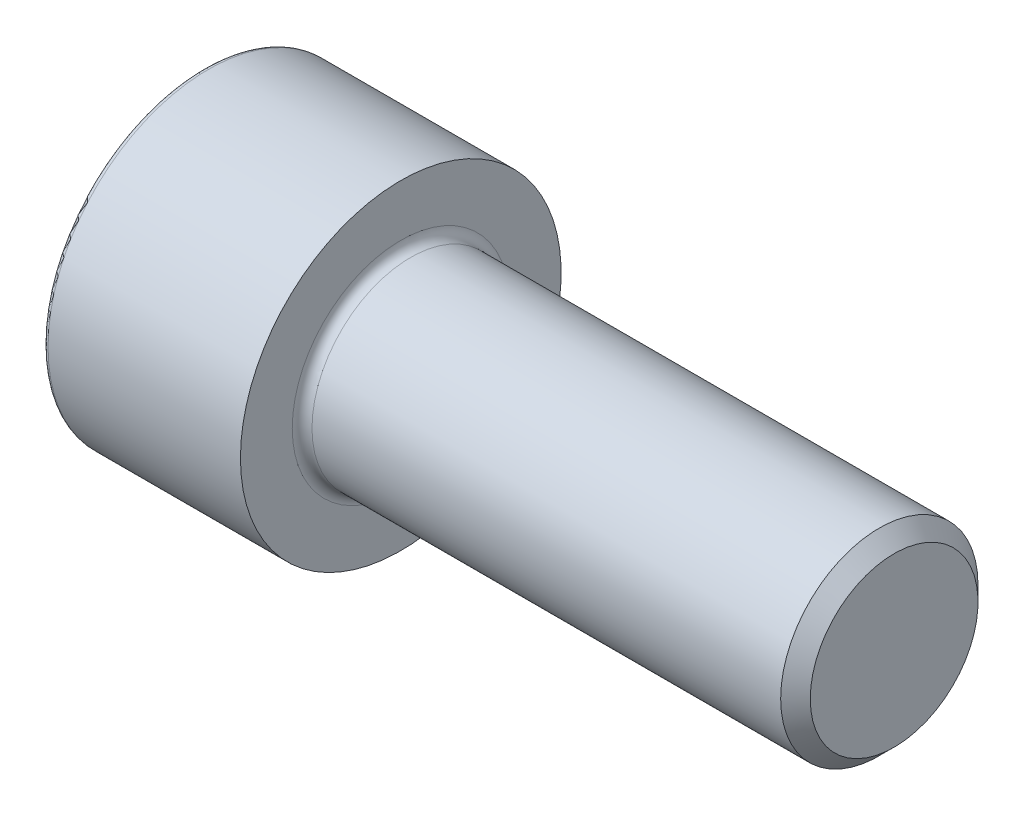
ISO-10303-21;
HEADER;
FILE_DESCRIPTION(('STEP AP214'),'2;1');
FILE_NAME('part.step','',(''),(''),'','','');
FILE_SCHEMA(('AUTOMOTIVE_DESIGN { 1 0 10303 214 1 1 1 1 }'));
ENDSEC;
DATA;
#1=APPLICATION_CONTEXT('core data for automotive mechanical design processes');
#2=APPLICATION_PROTOCOL_DEFINITION('international standard','automotive_design',2000,#1);
#3=PRODUCT_CONTEXT('',#1,'mechanical');
#4=PRODUCT('Part','Part','',(#3));
#5=PRODUCT_RELATED_PRODUCT_CATEGORY('part','',(#4));
#6=PRODUCT_DEFINITION_FORMATION('','',#4);
#7=PRODUCT_DEFINITION_CONTEXT('part definition',#1,'design');
#8=PRODUCT_DEFINITION('design','',#6,#7);
#9=PRODUCT_DEFINITION_SHAPE('','',#8);
#10=(LENGTH_UNIT() NAMED_UNIT(*) SI_UNIT(.MILLI.,.METRE.));
#11=(NAMED_UNIT(*) PLANE_ANGLE_UNIT() SI_UNIT($,.RADIAN.));
#12=(NAMED_UNIT(*) SI_UNIT($,.STERADIAN.) SOLID_ANGLE_UNIT());
#13=UNCERTAINTY_MEASURE_WITH_UNIT(LENGTH_MEASURE(1.E-05),#10,'distance_accuracy_value','');
#14=(GEOMETRIC_REPRESENTATION_CONTEXT(3) GLOBAL_UNCERTAINTY_ASSIGNED_CONTEXT((#13)) GLOBAL_UNIT_ASSIGNED_CONTEXT((#10,
#11,#12)) REPRESENTATION_CONTEXT('',''));
#15=CARTESIAN_POINT('',(0.,0.,0.));
#16=DIRECTION('',(0.,0.,1.));
#17=DIRECTION('',(1.,0.,0.));
#18=AXIS2_PLACEMENT_3D('',#15,#16,#17);
#19=CARTESIAN_POINT('',(0.,0.,0.));
#20=DIRECTION('',(1.,0.,0.));
#21=DIRECTION('',(0.,0.,-1.));
#22=AXIS2_PLACEMENT_3D('',#19,#20,#21);
#23=PLANE('',#22);
#24=CARTESIAN_POINT('',(0.,0.,0.));
#25=DIRECTION('',(1.,0.,0.));
#26=DIRECTION('',(0.,0.,-1.));
#27=AXIS2_PLACEMENT_3D('',#24,#25,#26);
#28=CIRCLE('',#27,6.3);
#29=CARTESIAN_POINT('',(0.,0.,-6.3));
#30=VERTEX_POINT('',#29);
#31=EDGE_CURVE('E180',#30,#30,#28,.F.);
#32=ORIENTED_EDGE('',*,*,#31,.T.);
#33=EDGE_LOOP('',(#32));
#34=FACE_BOUND('',#33,.T.);
#35=DIRECTION('',(0.,0.5,-0.866025403784439));
#36=VECTOR('',#35,1.);
#37=CARTESIAN_POINT('',(0.,1.73205080756889,3.));
#38=LINE('',#37,#36);
#39=CARTESIAN_POINT('',(0.,1.73205080756889,3.));
#40=VERTEX_POINT('',#39);
#41=CARTESIAN_POINT('',(0.,3.46410161513777,2.22044604925031E-13));
#42=VERTEX_POINT('',#41);
#43=EDGE_CURVE('E149',#40,#42,#38,.T.);
#44=ORIENTED_EDGE('',*,*,#43,.F.);
#45=DIRECTION('',(0.,1.,0.));
#46=VECTOR('',#45,1.);
#47=CARTESIAN_POINT('',(0.,-1.73205080756905,2.99999999999989));
#48=LINE('',#47,#46);
#49=CARTESIAN_POINT('',(0.,-1.73205080756905,2.99999999999989));
#50=VERTEX_POINT('',#49);
#51=EDGE_CURVE('E51',#50,#40,#48,.T.);
#52=ORIENTED_EDGE('',*,*,#51,.F.);
#53=DIRECTION('',(0.,0.5,0.866025403784439));
#54=VECTOR('',#53,1.);
#55=CARTESIAN_POINT('',(0.,-3.46410161513772,1.11022302462516E-13));
#56=LINE('',#55,#54);
#57=CARTESIAN_POINT('',(0.,-3.46410161513772,1.11022302462516E-13));
#58=VERTEX_POINT('',#57);
#59=EDGE_CURVE('E117',#58,#50,#56,.T.);
#60=ORIENTED_EDGE('',*,*,#59,.F.);
#61=DIRECTION('',(0.,-0.5,0.866025403784439));
#62=VECTOR('',#61,1.);
#63=CARTESIAN_POINT('',(0.,-1.73205080756883,-3.00000000000011));
#64=LINE('',#63,#62);
#65=CARTESIAN_POINT('',(0.,-1.73205080756883,-3.00000000000011));
#66=VERTEX_POINT('',#65);
#67=EDGE_CURVE('E157',#66,#58,#64,.T.);
#68=ORIENTED_EDGE('',*,*,#67,.F.);
#69=DIRECTION('',(0.,-1.,0.));
#70=VECTOR('',#69,1.);
#71=CARTESIAN_POINT('',(0.,1.73205080756877,-3.00000000000034));
#72=LINE('',#71,#70);
#73=CARTESIAN_POINT('',(0.,1.73205080756877,-3.00000000000034));
#74=VERTEX_POINT('',#73);
#75=EDGE_CURVE('E154',#74,#66,#72,.T.);
#76=ORIENTED_EDGE('',*,*,#75,.F.);
#77=DIRECTION('',(0.,-0.5,-0.866025403784439));
#78=VECTOR('',#77,1.);
#79=CARTESIAN_POINT('',(0.,3.46410161513777,2.22044604925031E-13));
#80=LINE('',#79,#78);
#81=EDGE_CURVE('E151',#42,#74,#80,.T.);
#82=ORIENTED_EDGE('',*,*,#81,.F.);
#83=EDGE_LOOP('',(#44,#52,#60,#68,#76,#82));
#84=FACE_BOUND('',#83,.T.);
#85=ADVANCED_FACE('F36',(#34,#84),#23,.F.);
#86=CARTESIAN_POINT('',(0.,0.,0.));
#87=DIRECTION('',(-1.,0.,0.));
#88=DIRECTION('',(0.,0.,1.));
#89=AXIS2_PLACEMENT_3D('',#86,#87,#88);
#90=CYLINDRICAL_SURFACE('',#89,6.5);
#91=CARTESIAN_POINT('',(0.200000000000006,0.,0.));
#92=DIRECTION('',(1.,0.,0.));
#93=DIRECTION('',(0.,0.,-1.));
#94=AXIS2_PLACEMENT_3D('',#91,#92,#93);
#95=CIRCLE('',#94,6.5);
#96=CARTESIAN_POINT('',(0.200000000000006,0.,-6.5));
#97=VERTEX_POINT('',#96);
#98=EDGE_CURVE('E183',#97,#97,#95,.T.);
#99=ORIENTED_EDGE('',*,*,#98,.T.);
#100=EDGE_LOOP('',(#99));
#101=FACE_BOUND('',#100,.T.);
#102=CARTESIAN_POINT('',(7.99999999999999,0.,0.));
#103=DIRECTION('',(-1.,0.,0.));
#104=DIRECTION('',(0.,0.,1.));
#105=AXIS2_PLACEMENT_3D('',#102,#103,#104);
#106=CIRCLE('',#105,6.5);
#107=CARTESIAN_POINT('',(7.99999999999999,0.,6.5));
#108=VERTEX_POINT('',#107);
#109=EDGE_CURVE('E176',#108,#108,#106,.T.);
#110=ORIENTED_EDGE('',*,*,#109,.T.);
#111=EDGE_LOOP('',(#110));
#112=FACE_BOUND('',#111,.T.);
#113=ADVANCED_FACE('F207',(#101,#112),#90,.T.);
#114=CARTESIAN_POINT('',(7.99999999999999,6.49999999999995,1.11022302462516E-13));
#115=DIRECTION('',(-1.,0.,0.));
#116=DIRECTION('',(0.,0.,1.));
#117=AXIS2_PLACEMENT_3D('',#114,#115,#116);
#118=PLANE('',#117);
#119=CARTESIAN_POINT('',(7.99999999999999,0.,0.));
#120=DIRECTION('',(-1.,0.,0.));
#121=DIRECTION('',(0.,0.,1.));
#122=AXIS2_PLACEMENT_3D('',#119,#120,#121);
#123=CIRCLE('',#122,4.4);
#124=CARTESIAN_POINT('',(7.99999999999999,0.,4.4));
#125=VERTEX_POINT('',#124);
#126=EDGE_CURVE('E44',#125,#125,#123,.T.);
#127=ORIENTED_EDGE('',*,*,#126,.T.);
#128=EDGE_LOOP('',(#127));
#129=FACE_BOUND('',#128,.T.);
#130=ORIENTED_EDGE('',*,*,#109,.F.);
#131=EDGE_LOOP('',(#130));
#132=FACE_BOUND('',#131,.T.);
#133=ADVANCED_FACE('F194',(#129,#132),#118,.F.);
#134=CARTESIAN_POINT('',(0.,0.,0.));
#135=DIRECTION('',(-1.,0.,0.));
#136=DIRECTION('',(0.,0.,1.));
#137=AXIS2_PLACEMENT_3D('',#134,#135,#136);
#138=CYLINDRICAL_SURFACE('',#137,4.);
#139=CARTESIAN_POINT('',(8.4,0.,0.));
#140=DIRECTION('',(-1.,0.,0.));
#141=DIRECTION('',(0.,0.,1.));
#142=AXIS2_PLACEMENT_3D('',#139,#140,#141);
#143=CIRCLE('',#142,4.);
#144=CARTESIAN_POINT('',(8.4,0.,4.));
#145=VERTEX_POINT('',#144);
#146=EDGE_CURVE('E11',#145,#145,#143,.F.);
#147=ORIENTED_EDGE('',*,*,#146,.T.);
#148=EDGE_LOOP('',(#147));
#149=FACE_BOUND('',#148,.T.);
#150=CARTESIAN_POINT('',(27.4,0.,0.));
#151=DIRECTION('',(-1.,0.,0.));
#152=DIRECTION('',(0.,0.,1.));
#153=AXIS2_PLACEMENT_3D('',#150,#151,#152);
#154=CIRCLE('',#153,4.);
#155=CARTESIAN_POINT('',(27.4,0.,4.));
#156=VERTEX_POINT('',#155);
#157=EDGE_CURVE('E186',#156,#156,#154,.T.);
#158=ORIENTED_EDGE('',*,*,#157,.T.);
#159=EDGE_LOOP('',(#158));
#160=FACE_BOUND('',#159,.T.);
#161=ADVANCED_FACE('F232',(#149,#160),#138,.T.);
#162=CARTESIAN_POINT('',(28.,3.99999999999995,0.));
#163=DIRECTION('',(-1.,0.,0.));
#164=DIRECTION('',(0.,0.,1.));
#165=AXIS2_PLACEMENT_3D('',#162,#163,#164);
#166=PLANE('',#165);
#167=CARTESIAN_POINT('',(28.,0.,0.));
#168=DIRECTION('',(-1.,0.,0.));
#169=DIRECTION('',(0.,0.,1.));
#170=AXIS2_PLACEMENT_3D('',#167,#168,#169);
#171=CIRCLE('',#170,3.39999999999999);
#172=CARTESIAN_POINT('',(28.,0.,3.39999999999999));
#173=VERTEX_POINT('',#172);
#174=EDGE_CURVE('E189',#173,#173,#171,.F.);
#175=ORIENTED_EDGE('',*,*,#174,.T.);
#176=EDGE_LOOP('',(#175));
#177=FACE_BOUND('',#176,.T.);
#178=ADVANCED_FACE('F236',(#177),#166,.F.);
#179=CARTESIAN_POINT('',(3.99999999999999,-1.73205080756905,2.99999999999989));
#180=DIRECTION('',(0.,0.,1.));
#181=DIRECTION('',(0.,-1.,0.));
#182=AXIS2_PLACEMENT_3D('',#179,#180,#181);
#183=PLANE('',#182);
#184=ORIENTED_EDGE('',*,*,#51,.T.);
#185=DIRECTION('',(-1.,0.,0.));
#186=VECTOR('',#185,1.);
#187=CARTESIAN_POINT('',(3.99999999999999,1.73205080756889,3.));
#188=LINE('',#187,#186);
#189=CARTESIAN_POINT('',(3.99999999999999,1.73205080756889,3.));
#190=VERTEX_POINT('',#189);
#191=EDGE_CURVE('E120',#190,#40,#188,.T.);
#192=ORIENTED_EDGE('',*,*,#191,.F.);
#193=DIRECTION('',(0.,1.,0.));
#194=VECTOR('',#193,1.);
#195=CARTESIAN_POINT('',(3.99999999999999,-1.73205080756905,2.99999999999989));
#196=LINE('',#195,#194);
#197=CARTESIAN_POINT('',(3.99999999999999,0.,3.));
#198=VERTEX_POINT('',#197);
#199=EDGE_CURVE('E110',#198,#190,#196,.T.);
#200=ORIENTED_EDGE('',*,*,#199,.F.);
#201=CARTESIAN_POINT('',(3.99999999999999,-1.73205080756905,2.99999999999989));
#202=VERTEX_POINT('',#201);
#203=EDGE_CURVE('E116',#202,#198,#196,.T.);
#204=ORIENTED_EDGE('',*,*,#203,.F.);
#205=DIRECTION('',(-1.,0.,0.));
#206=VECTOR('',#205,1.);
#207=CARTESIAN_POINT('',(3.99999999999999,-1.73205080756905,2.99999999999989));
#208=LINE('',#207,#206);
#209=EDGE_CURVE('E161',#202,#50,#208,.T.);
#210=ORIENTED_EDGE('',*,*,#209,.T.);
#211=EDGE_LOOP('',(#184,#192,#200,#204,#210));
#212=FACE_BOUND('',#211,.T.);
#213=ADVANCED_FACE('F121',(#212),#183,.F.);
#214=CARTESIAN_POINT('',(4.,-3.46410161513772,1.11022302462516E-13));
#215=DIRECTION('',(0.,-0.866025403784439,0.5));
#216=DIRECTION('',(0.,-0.5,-0.866025403784439));
#217=AXIS2_PLACEMENT_3D('',#214,#215,#216);
#218=PLANE('',#217);
#219=ORIENTED_EDGE('',*,*,#59,.T.);
#220=ORIENTED_EDGE('',*,*,#209,.F.);
#221=DIRECTION('',(0.,0.5,0.866025403784439));
#222=VECTOR('',#221,1.);
#223=CARTESIAN_POINT('',(4.,-3.46410161513772,1.11022302462516E-13));
#224=LINE('',#223,#222);
#225=CARTESIAN_POINT('',(3.99999999999999,-2.59807621135333,1.49999999999995));
#226=VERTEX_POINT('',#225);
#227=EDGE_CURVE('E145',#226,#202,#224,.T.);
#228=ORIENTED_EDGE('',*,*,#227,.F.);
#229=CARTESIAN_POINT('',(4.,-3.46410161513772,1.11022302462516E-13));
#230=VERTEX_POINT('',#229);
#231=EDGE_CURVE('E125',#230,#226,#224,.T.);
#232=ORIENTED_EDGE('',*,*,#231,.F.);
#233=DIRECTION('',(-1.,0.,0.));
#234=VECTOR('',#233,1.);
#235=CARTESIAN_POINT('',(4.,-3.46410161513772,1.11022302462516E-13));
#236=LINE('',#235,#234);
#237=EDGE_CURVE('E164',#230,#58,#236,.T.);
#238=ORIENTED_EDGE('',*,*,#237,.T.);
#239=EDGE_LOOP('',(#219,#220,#228,#232,#238));
#240=FACE_BOUND('',#239,.T.);
#241=ADVANCED_FACE('F245',(#240),#218,.F.);
#242=CARTESIAN_POINT('',(4.,-1.73205080756883,-2.99999999999978));
#243=DIRECTION('',(0.,-0.866025403784439,-0.5));
#244=DIRECTION('',(0.,0.5,-0.866025403784439));
#245=AXIS2_PLACEMENT_3D('',#242,#243,#244);
#246=PLANE('',#245);
#247=ORIENTED_EDGE('',*,*,#67,.T.);
#248=ORIENTED_EDGE('',*,*,#237,.F.);
#249=DIRECTION('',(0.,-0.5,0.866025403784439));
#250=VECTOR('',#249,1.);
#251=CARTESIAN_POINT('',(4.,-1.73205080756883,-2.99999999999978));
#252=LINE('',#251,#250);
#253=CARTESIAN_POINT('',(4.,-2.59807621135322,-1.50000000000006));
#254=VERTEX_POINT('',#253);
#255=EDGE_CURVE('E141',#254,#230,#252,.T.);
#256=ORIENTED_EDGE('',*,*,#255,.F.);
#257=CARTESIAN_POINT('',(4.,-1.73205080756883,-2.99999999999978));
#258=VERTEX_POINT('',#257);
#259=EDGE_CURVE('E142',#258,#254,#252,.T.);
#260=ORIENTED_EDGE('',*,*,#259,.F.);
#261=DIRECTION('',(-1.,0.,0.));
#262=VECTOR('',#261,1.);
#263=CARTESIAN_POINT('',(4.,-1.73205080756883,-2.99999999999978));
#264=LINE('',#263,#262);
#265=EDGE_CURVE('E167',#258,#66,#264,.T.);
#266=ORIENTED_EDGE('',*,*,#265,.T.);
#267=EDGE_LOOP('',(#247,#248,#256,#260,#266));
#268=FACE_BOUND('',#267,.T.);
#269=ADVANCED_FACE('F256',(#268),#246,.F.);
#270=CARTESIAN_POINT('',(4.,1.73205080756877,-3.00000000000034));
#271=DIRECTION('',(0.,0.,-1.));
#272=DIRECTION('',(0.,1.,0.));
#273=AXIS2_PLACEMENT_3D('',#270,#271,#272);
#274=PLANE('',#273);
#275=ORIENTED_EDGE('',*,*,#75,.T.);
#276=ORIENTED_EDGE('',*,*,#265,.F.);
#277=DIRECTION('',(0.,-1.,0.));
#278=VECTOR('',#277,1.);
#279=CARTESIAN_POINT('',(4.,1.73205080756877,-3.00000000000034));
#280=LINE('',#279,#278);
#281=CARTESIAN_POINT('',(4.,-1.66533453693773E-13,-2.99999999999978));
#282=VERTEX_POINT('',#281);
#283=EDGE_CURVE('E137',#282,#258,#280,.T.);
#284=ORIENTED_EDGE('',*,*,#283,.F.);
#285=CARTESIAN_POINT('',(4.,1.73205080756877,-3.00000000000034));
#286=VERTEX_POINT('',#285);
#287=EDGE_CURVE('E138',#286,#282,#280,.T.);
#288=ORIENTED_EDGE('',*,*,#287,.F.);
#289=DIRECTION('',(-1.,0.,0.));
#290=VECTOR('',#289,1.);
#291=CARTESIAN_POINT('',(4.,1.73205080756877,-3.00000000000034));
#292=LINE('',#291,#290);
#293=EDGE_CURVE('E170',#286,#74,#292,.T.);
#294=ORIENTED_EDGE('',*,*,#293,.T.);
#295=EDGE_LOOP('',(#275,#276,#284,#288,#294));
#296=FACE_BOUND('',#295,.T.);
#297=ADVANCED_FACE('F252',(#296),#274,.F.);
#298=CARTESIAN_POINT('',(4.,3.46410161513777,2.22044604925031E-13));
#299=DIRECTION('',(0.,0.866025403784439,-0.5));
#300=DIRECTION('',(0.,0.5,0.866025403784439));
#301=AXIS2_PLACEMENT_3D('',#298,#299,#300);
#302=PLANE('',#301);
#303=ORIENTED_EDGE('',*,*,#81,.T.);
#304=ORIENTED_EDGE('',*,*,#293,.F.);
#305=DIRECTION('',(0.,-0.5,-0.866025403784439));
#306=VECTOR('',#305,1.);
#307=CARTESIAN_POINT('',(4.,3.46410161513777,2.22044604925031E-13));
#308=LINE('',#307,#306);
#309=CARTESIAN_POINT('',(4.,2.59807621135327,-1.49999999999995));
#310=VERTEX_POINT('',#309);
#311=EDGE_CURVE('E131',#310,#286,#308,.T.);
#312=ORIENTED_EDGE('',*,*,#311,.F.);
#313=CARTESIAN_POINT('',(4.,3.46410161513777,2.22044604925031E-13));
#314=VERTEX_POINT('',#313);
#315=EDGE_CURVE('E133',#314,#310,#308,.T.);
#316=ORIENTED_EDGE('',*,*,#315,.F.);
#317=DIRECTION('',(-1.,0.,0.));
#318=VECTOR('',#317,1.);
#319=CARTESIAN_POINT('',(4.,3.46410161513777,2.22044604925031E-13));
#320=LINE('',#319,#318);
#321=EDGE_CURVE('E124',#314,#42,#320,.T.);
#322=ORIENTED_EDGE('',*,*,#321,.T.);
#323=EDGE_LOOP('',(#303,#304,#312,#316,#322));
#324=FACE_BOUND('',#323,.T.);
#325=ADVANCED_FACE('F249',(#324),#302,.F.);
#326=CARTESIAN_POINT('',(3.99999999999999,1.73205080756889,3.));
#327=DIRECTION('',(0.,0.866025403784439,0.5));
#328=DIRECTION('',(0.,-0.5,0.866025403784439));
#329=AXIS2_PLACEMENT_3D('',#326,#327,#328);
#330=PLANE('',#329);
#331=ORIENTED_EDGE('',*,*,#43,.T.);
#332=ORIENTED_EDGE('',*,*,#321,.F.);
#333=DIRECTION('',(0.,0.5,-0.866025403784439));
#334=VECTOR('',#333,1.);
#335=CARTESIAN_POINT('',(3.99999999999999,1.73205080756889,3.));
#336=LINE('',#335,#334);
#337=CARTESIAN_POINT('',(4.,2.59807621135338,1.50000000000006));
#338=VERTEX_POINT('',#337);
#339=EDGE_CURVE('E129',#338,#314,#336,.T.);
#340=ORIENTED_EDGE('',*,*,#339,.F.);
#341=EDGE_CURVE('E59',#190,#338,#336,.T.);
#342=ORIENTED_EDGE('',*,*,#341,.F.);
#343=ORIENTED_EDGE('',*,*,#191,.T.);
#344=EDGE_LOOP('',(#331,#332,#340,#342,#343));
#345=FACE_BOUND('',#344,.T.);
#346=ADVANCED_FACE('F127',(#345),#330,.F.);
#347=CARTESIAN_POINT('',(4.,0.,0.));
#348=DIRECTION('',(-1.,0.,0.));
#349=DIRECTION('',(0.,0.,1.));
#350=AXIS2_PLACEMENT_3D('',#347,#348,#349);
#351=PLANE('',#350);
#352=CARTESIAN_POINT('',(4.,0.,0.));
#353=DIRECTION('',(-1.,0.,0.));
#354=DIRECTION('',(0.,0.,1.));
#355=AXIS2_PLACEMENT_3D('',#352,#353,#354);
#356=CIRCLE('',#355,3.);
#357=EDGE_CURVE('E163',#226,#198,#356,.T.);
#358=ORIENTED_EDGE('',*,*,#357,.F.);
#359=ORIENTED_EDGE('',*,*,#227,.T.);
#360=ORIENTED_EDGE('',*,*,#203,.T.);
#361=EDGE_LOOP('',(#358,#359,#360));
#362=FACE_BOUND('',#361,.T.);
#363=ADVANCED_FACE('F248',(#362),#351,.T.);
#364=EDGE_CURVE('E291',#254,#226,#356,.T.);
#365=ORIENTED_EDGE('',*,*,#364,.F.);
#366=ORIENTED_EDGE('',*,*,#255,.T.);
#367=ORIENTED_EDGE('',*,*,#231,.T.);
#368=EDGE_LOOP('',(#365,#366,#367));
#369=FACE_BOUND('',#368,.T.);
#370=ADVANCED_FACE('F265',(#369),#351,.T.);
#371=EDGE_CURVE('E293',#282,#254,#356,.T.);
#372=ORIENTED_EDGE('',*,*,#371,.F.);
#373=ORIENTED_EDGE('',*,*,#283,.T.);
#374=ORIENTED_EDGE('',*,*,#259,.T.);
#375=EDGE_LOOP('',(#372,#373,#374));
#376=FACE_BOUND('',#375,.T.);
#377=ADVANCED_FACE('F270',(#376),#351,.T.);
#378=EDGE_CURVE('E287',#310,#282,#356,.T.);
#379=ORIENTED_EDGE('',*,*,#378,.F.);
#380=ORIENTED_EDGE('',*,*,#311,.T.);
#381=ORIENTED_EDGE('',*,*,#287,.T.);
#382=EDGE_LOOP('',(#379,#380,#381));
#383=FACE_BOUND('',#382,.T.);
#384=ADVANCED_FACE('F277',(#383),#351,.T.);
#385=EDGE_CURVE('E177',#338,#310,#356,.T.);
#386=ORIENTED_EDGE('',*,*,#385,.F.);
#387=ORIENTED_EDGE('',*,*,#339,.T.);
#388=ORIENTED_EDGE('',*,*,#315,.T.);
#389=EDGE_LOOP('',(#386,#387,#388));
#390=FACE_BOUND('',#389,.T.);
#391=ADVANCED_FACE('F273',(#390),#351,.T.);
#392=EDGE_CURVE('E113',#198,#338,#356,.T.);
#393=ORIENTED_EDGE('',*,*,#392,.F.);
#394=ORIENTED_EDGE('',*,*,#199,.T.);
#395=ORIENTED_EDGE('',*,*,#341,.T.);
#396=EDGE_LOOP('',(#393,#394,#395));
#397=FACE_BOUND('',#396,.T.);
#398=ADVANCED_FACE('F111',(#397),#351,.T.);
#399=CARTESIAN_POINT('',(4.,0.,0.));
#400=DIRECTION('',(-1.,0.,0.));
#401=DIRECTION('',(0.,0.,1.));
#402=AXIS2_PLACEMENT_3D('',#399,#400,#401);
#403=CONICAL_SURFACE('',#402,3.,1.02974425867665);
#404=CARTESIAN_POINT('',(5.80258185708268,0.,0.));
#405=VERTEX_POINT('',#404);
#406=VERTEX_LOOP('',#405);
#407=FACE_BOUND('',#406,.T.);
#408=ORIENTED_EDGE('',*,*,#392,.T.);
#409=ORIENTED_EDGE('',*,*,#385,.T.);
#410=ORIENTED_EDGE('',*,*,#378,.T.);
#411=ORIENTED_EDGE('',*,*,#371,.T.);
#412=ORIENTED_EDGE('',*,*,#364,.T.);
#413=ORIENTED_EDGE('',*,*,#357,.T.);
#414=EDGE_LOOP('',(#408,#409,#410,#411,#412,#413));
#415=FACE_BOUND('',#414,.T.);
#416=ADVANCED_FACE('F219',(#407,#415),#403,.F.);
#417=CARTESIAN_POINT('',(0.200000000000006,0.,0.));
#418=DIRECTION('',(1.,0.,0.));
#419=DIRECTION('',(0.,0.,-1.));
#420=AXIS2_PLACEMENT_3D('',#417,#418,#419);
#421=TOROIDAL_SURFACE('',#420,6.3,0.2);
#422=ORIENTED_EDGE('',*,*,#98,.F.);
#423=EDGE_LOOP('',(#422));
#424=FACE_BOUND('',#423,.T.);
#425=ORIENTED_EDGE('',*,*,#31,.F.);
#426=EDGE_LOOP('',(#425));
#427=FACE_BOUND('',#426,.T.);
#428=ADVANCED_FACE('F203',(#424,#427),#421,.T.);
#429=CARTESIAN_POINT('',(27.4,0.,0.));
#430=DIRECTION('',(-1.,0.,0.));
#431=DIRECTION('',(0.,0.,1.));
#432=AXIS2_PLACEMENT_3D('',#429,#430,#431);
#433=CONICAL_SURFACE('',#432,4.,0.785398163397451);
#434=ORIENTED_EDGE('',*,*,#174,.F.);
#435=EDGE_LOOP('',(#434));
#436=FACE_BOUND('',#435,.T.);
#437=ORIENTED_EDGE('',*,*,#157,.F.);
#438=EDGE_LOOP('',(#437));
#439=FACE_BOUND('',#438,.T.);
#440=ADVANCED_FACE('F198',(#436,#439),#433,.T.);
#441=CARTESIAN_POINT('',(8.4,0.,0.));
#442=DIRECTION('',(-1.,0.,0.));
#443=DIRECTION('',(0.,0.,1.));
#444=AXIS2_PLACEMENT_3D('',#441,#442,#443);
#445=TOROIDAL_SURFACE('',#444,4.4,0.4);
#446=ORIENTED_EDGE('',*,*,#146,.F.);
#447=EDGE_LOOP('',(#446));
#448=FACE_BOUND('',#447,.T.);
#449=ORIENTED_EDGE('',*,*,#126,.F.);
#450=EDGE_LOOP('',(#449));
#451=FACE_BOUND('',#450,.T.);
#452=ADVANCED_FACE('F38',(#448,#451),#445,.F.);
#453=CLOSED_SHELL('',(#85,#113,#133,#161,#178,#213,#241,#269,#297,#325,#346,#363,#370,#377,#384,
#391,#398,#416,#428,#440,#452));
#454=MANIFOLD_SOLID_BREP('B2',#453);
#455=ADVANCED_BREP_SHAPE_REPRESENTATION('',(#18,#454),#14);
#456=SHAPE_DEFINITION_REPRESENTATION(#9,#455);
ENDSEC;
END-ISO-10303-21;
